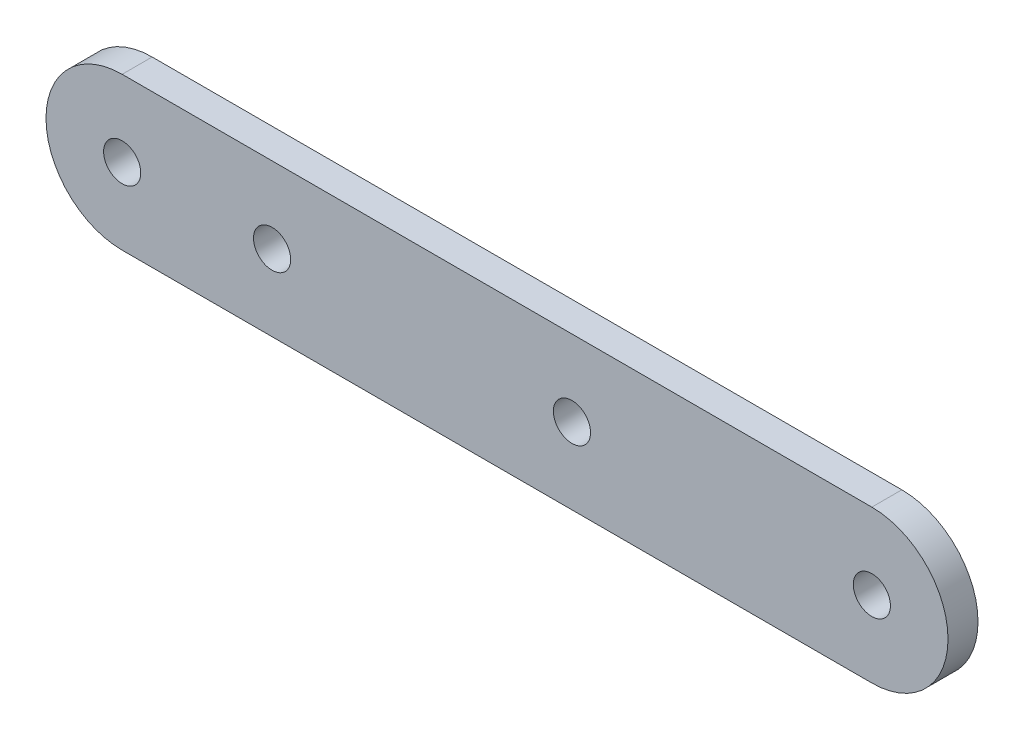
ISO-10303-21;
HEADER;
FILE_DESCRIPTION(('STEP AP214'),'2;1');
FILE_NAME('part.step','',(''),(''),'','','');
FILE_SCHEMA(('AUTOMOTIVE_DESIGN { 1 0 10303 214 1 1 1 1 }'));
ENDSEC;
DATA;
#1=APPLICATION_CONTEXT('core data for automotive mechanical design processes');
#2=APPLICATION_PROTOCOL_DEFINITION('international standard','automotive_design',2000,#1);
#3=PRODUCT_CONTEXT('',#1,'mechanical');
#4=PRODUCT('Part','Part','',(#3));
#5=PRODUCT_RELATED_PRODUCT_CATEGORY('part','',(#4));
#6=PRODUCT_DEFINITION_FORMATION('','',#4);
#7=PRODUCT_DEFINITION_CONTEXT('part definition',#1,'design');
#8=PRODUCT_DEFINITION('design','',#6,#7);
#9=PRODUCT_DEFINITION_SHAPE('','',#8);
#10=(LENGTH_UNIT() NAMED_UNIT(*) SI_UNIT(.MILLI.,.METRE.));
#11=(NAMED_UNIT(*) PLANE_ANGLE_UNIT() SI_UNIT($,.RADIAN.));
#12=(NAMED_UNIT(*) SI_UNIT($,.STERADIAN.) SOLID_ANGLE_UNIT());
#13=UNCERTAINTY_MEASURE_WITH_UNIT(LENGTH_MEASURE(1.E-05),#10,'distance_accuracy_value','');
#14=(GEOMETRIC_REPRESENTATION_CONTEXT(3) GLOBAL_UNCERTAINTY_ASSIGNED_CONTEXT((#13)) GLOBAL_UNIT_ASSIGNED_CONTEXT((#10,
#11,#12)) REPRESENTATION_CONTEXT('',''));
#15=CARTESIAN_POINT('',(0.,0.,0.));
#16=DIRECTION('',(0.,0.,1.));
#17=DIRECTION('',(1.,0.,0.));
#18=AXIS2_PLACEMENT_3D('',#15,#16,#17);
#19=CARTESIAN_POINT('',(0.,0.,5.));
#20=DIRECTION('',(0.,0.,1.));
#21=DIRECTION('',(1.,0.,0.));
#22=AXIS2_PLACEMENT_3D('',#19,#20,#21);
#23=PLANE('',#22);
#24=CARTESIAN_POINT('',(125.,0.,5.));
#25=DIRECTION('',(0.,0.,1.));
#26=DIRECTION('',(-1.,0.,0.));
#27=AXIS2_PLACEMENT_3D('',#24,#25,#26);
#28=CIRCLE('',#27,3.09999999999999);
#29=CARTESIAN_POINT('',(121.9,0.,5.));
#30=VERTEX_POINT('',#29);
#31=EDGE_CURVE('E142',#30,#30,#28,.T.);
#32=ORIENTED_EDGE('',*,*,#31,.F.);
#33=EDGE_LOOP('',(#32));
#34=FACE_BOUND('',#33,.T.);
#35=CARTESIAN_POINT('',(0.,0.,5.));
#36=DIRECTION('',(0.,0.,1.));
#37=DIRECTION('',(1.,0.,0.));
#38=AXIS2_PLACEMENT_3D('',#35,#36,#37);
#39=CIRCLE('',#38,3.1);
#40=CARTESIAN_POINT('',(3.1,0.,5.));
#41=VERTEX_POINT('',#40);
#42=EDGE_CURVE('E112',#41,#41,#39,.T.);
#43=ORIENTED_EDGE('',*,*,#42,.F.);
#44=EDGE_LOOP('',(#43));
#45=FACE_BOUND('',#44,.T.);
#46=CARTESIAN_POINT('',(0.,0.,5.));
#47=DIRECTION('',(0.,0.,1.));
#48=DIRECTION('',(1.,0.,0.));
#49=AXIS2_PLACEMENT_3D('',#46,#47,#48);
#50=CIRCLE('',#49,12.7);
#51=CARTESIAN_POINT('',(0.,12.7,5.));
#52=VERTEX_POINT('',#51);
#53=CARTESIAN_POINT('',(0.,-12.7,5.));
#54=VERTEX_POINT('',#53);
#55=EDGE_CURVE('E92',#52,#54,#50,.T.);
#56=ORIENTED_EDGE('',*,*,#55,.T.);
#57=DIRECTION('',(1.,0.,0.));
#58=VECTOR('',#57,1.);
#59=CARTESIAN_POINT('',(0.,-12.7,5.));
#60=LINE('',#59,#58);
#61=CARTESIAN_POINT('',(125.,-12.7,5.));
#62=VERTEX_POINT('',#61);
#63=EDGE_CURVE('E87',#54,#62,#60,.T.);
#64=ORIENTED_EDGE('',*,*,#63,.T.);
#65=CARTESIAN_POINT('',(125.,0.,5.));
#66=DIRECTION('',(0.,0.,1.));
#67=DIRECTION('',(-1.,0.,0.));
#68=AXIS2_PLACEMENT_3D('',#65,#66,#67);
#69=CIRCLE('',#68,12.7);
#70=CARTESIAN_POINT('',(125.,12.7,5.));
#71=VERTEX_POINT('',#70);
#72=EDGE_CURVE('E90',#62,#71,#69,.T.);
#73=ORIENTED_EDGE('',*,*,#72,.T.);
#74=DIRECTION('',(-1.,0.,0.));
#75=VECTOR('',#74,1.);
#76=CARTESIAN_POINT('',(0.,12.7,5.));
#77=LINE('',#76,#75);
#78=EDGE_CURVE('E57',#71,#52,#77,.T.);
#79=ORIENTED_EDGE('',*,*,#78,.T.);
#80=EDGE_LOOP('',(#56,#64,#73,#79));
#81=FACE_BOUND('',#80,.T.);
#82=CARTESIAN_POINT('',(25.,0.,5.));
#83=DIRECTION('',(0.,0.,1.));
#84=DIRECTION('',(1.,0.,0.));
#85=AXIS2_PLACEMENT_3D('',#82,#83,#84);
#86=CIRCLE('',#85,3.1);
#87=CARTESIAN_POINT('',(28.1,0.,5.));
#88=VERTEX_POINT('',#87);
#89=EDGE_CURVE('E134',#88,#88,#86,.T.);
#90=ORIENTED_EDGE('',*,*,#89,.F.);
#91=EDGE_LOOP('',(#90));
#92=FACE_BOUND('',#91,.T.);
#93=CARTESIAN_POINT('',(75.,0.,5.));
#94=DIRECTION('',(0.,0.,1.));
#95=DIRECTION('',(1.,0.,0.));
#96=AXIS2_PLACEMENT_3D('',#93,#94,#95);
#97=CIRCLE('',#96,3.09999999999999);
#98=CARTESIAN_POINT('',(78.1,0.,5.));
#99=VERTEX_POINT('',#98);
#100=EDGE_CURVE('E150',#99,#99,#97,.T.);
#101=ORIENTED_EDGE('',*,*,#100,.F.);
#102=EDGE_LOOP('',(#101));
#103=FACE_BOUND('',#102,.T.);
#104=ADVANCED_FACE('F39',(#34,#45,#81,#92,#103),#23,.T.);
#105=CARTESIAN_POINT('',(0.,0.,0.));
#106=DIRECTION('',(0.,0.,1.));
#107=DIRECTION('',(1.,0.,0.));
#108=AXIS2_PLACEMENT_3D('',#105,#106,#107);
#109=PLANE('',#108);
#110=CARTESIAN_POINT('',(0.,0.,0.));
#111=DIRECTION('',(0.,0.,1.));
#112=DIRECTION('',(1.,0.,0.));
#113=AXIS2_PLACEMENT_3D('',#110,#111,#112);
#114=CIRCLE('',#113,12.7);
#115=CARTESIAN_POINT('',(0.,12.7,0.));
#116=VERTEX_POINT('',#115);
#117=CARTESIAN_POINT('',(0.,-12.7,0.));
#118=VERTEX_POINT('',#117);
#119=EDGE_CURVE('E108',#116,#118,#114,.T.);
#120=ORIENTED_EDGE('',*,*,#119,.F.);
#121=DIRECTION('',(-1.,0.,0.));
#122=VECTOR('',#121,1.);
#123=CARTESIAN_POINT('',(0.,12.7,0.));
#124=LINE('',#123,#122);
#125=CARTESIAN_POINT('',(125.,12.7,0.));
#126=VERTEX_POINT('',#125);
#127=EDGE_CURVE('E80',#126,#116,#124,.T.);
#128=ORIENTED_EDGE('',*,*,#127,.F.);
#129=CARTESIAN_POINT('',(125.,0.,0.));
#130=DIRECTION('',(0.,0.,1.));
#131=DIRECTION('',(-1.,0.,0.));
#132=AXIS2_PLACEMENT_3D('',#129,#130,#131);
#133=CIRCLE('',#132,12.7);
#134=CARTESIAN_POINT('',(125.,-12.7,0.));
#135=VERTEX_POINT('',#134);
#136=EDGE_CURVE('E74',#135,#126,#133,.T.);
#137=ORIENTED_EDGE('',*,*,#136,.F.);
#138=DIRECTION('',(1.,0.,0.));
#139=VECTOR('',#138,1.);
#140=CARTESIAN_POINT('',(0.,-12.7,0.));
#141=LINE('',#140,#139);
#142=EDGE_CURVE('E97',#118,#135,#141,.T.);
#143=ORIENTED_EDGE('',*,*,#142,.F.);
#144=EDGE_LOOP('',(#120,#128,#137,#143));
#145=FACE_BOUND('',#144,.T.);
#146=CARTESIAN_POINT('',(0.,0.,0.));
#147=DIRECTION('',(0.,0.,1.));
#148=DIRECTION('',(1.,0.,0.));
#149=AXIS2_PLACEMENT_3D('',#146,#147,#148);
#150=CIRCLE('',#149,3.1);
#151=CARTESIAN_POINT('',(3.1,0.,0.));
#152=VERTEX_POINT('',#151);
#153=EDGE_CURVE('E130',#152,#152,#150,.T.);
#154=ORIENTED_EDGE('',*,*,#153,.T.);
#155=EDGE_LOOP('',(#154));
#156=FACE_BOUND('',#155,.T.);
#157=CARTESIAN_POINT('',(25.,0.,0.));
#158=DIRECTION('',(0.,0.,1.));
#159=DIRECTION('',(1.,0.,0.));
#160=AXIS2_PLACEMENT_3D('',#157,#158,#159);
#161=CIRCLE('',#160,3.1);
#162=CARTESIAN_POINT('',(28.1,0.,0.));
#163=VERTEX_POINT('',#162);
#164=EDGE_CURVE('E138',#163,#163,#161,.T.);
#165=ORIENTED_EDGE('',*,*,#164,.T.);
#166=EDGE_LOOP('',(#165));
#167=FACE_BOUND('',#166,.T.);
#168=CARTESIAN_POINT('',(125.,0.,0.));
#169=DIRECTION('',(0.,0.,1.));
#170=DIRECTION('',(-1.,0.,0.));
#171=AXIS2_PLACEMENT_3D('',#168,#169,#170);
#172=CIRCLE('',#171,3.09999999999999);
#173=CARTESIAN_POINT('',(121.9,0.,0.));
#174=VERTEX_POINT('',#173);
#175=EDGE_CURVE('E146',#174,#174,#172,.T.);
#176=ORIENTED_EDGE('',*,*,#175,.T.);
#177=EDGE_LOOP('',(#176));
#178=FACE_BOUND('',#177,.T.);
#179=CARTESIAN_POINT('',(75.,0.,0.));
#180=DIRECTION('',(0.,0.,1.));
#181=DIRECTION('',(1.,0.,0.));
#182=AXIS2_PLACEMENT_3D('',#179,#180,#181);
#183=CIRCLE('',#182,3.09999999999999);
#184=CARTESIAN_POINT('',(78.1,0.,0.));
#185=VERTEX_POINT('',#184);
#186=EDGE_CURVE('E154',#185,#185,#183,.T.);
#187=ORIENTED_EDGE('',*,*,#186,.T.);
#188=EDGE_LOOP('',(#187));
#189=FACE_BOUND('',#188,.T.);
#190=ADVANCED_FACE('F125',(#145,#156,#167,#178,#189),#109,.F.);
#191=CARTESIAN_POINT('',(0.,0.,5.));
#192=DIRECTION('',(0.,0.,-1.));
#193=DIRECTION('',(-1.,0.,0.));
#194=AXIS2_PLACEMENT_3D('',#191,#192,#193);
#195=CYLINDRICAL_SURFACE('',#194,12.7);
#196=ORIENTED_EDGE('',*,*,#119,.T.);
#197=DIRECTION('',(0.,0.,-1.));
#198=VECTOR('',#197,1.);
#199=CARTESIAN_POINT('',(0.,-12.7,5.));
#200=LINE('',#199,#198);
#201=EDGE_CURVE('E11',#54,#118,#200,.T.);
#202=ORIENTED_EDGE('',*,*,#201,.F.);
#203=ORIENTED_EDGE('',*,*,#55,.F.);
#204=DIRECTION('',(0.,0.,-1.));
#205=VECTOR('',#204,1.);
#206=CARTESIAN_POINT('',(0.,12.7,5.));
#207=LINE('',#206,#205);
#208=EDGE_CURVE('E104',#52,#116,#207,.T.);
#209=ORIENTED_EDGE('',*,*,#208,.T.);
#210=EDGE_LOOP('',(#196,#202,#203,#209));
#211=FACE_BOUND('',#210,.T.);
#212=ADVANCED_FACE('F41',(#211),#195,.T.);
#213=CARTESIAN_POINT('',(0.,-12.7,5.));
#214=DIRECTION('',(0.,1.,0.));
#215=DIRECTION('',(-1.,0.,0.));
#216=AXIS2_PLACEMENT_3D('',#213,#214,#215);
#217=PLANE('',#216);
#218=ORIENTED_EDGE('',*,*,#142,.T.);
#219=DIRECTION('',(0.,0.,-1.));
#220=VECTOR('',#219,1.);
#221=CARTESIAN_POINT('',(125.,-12.7,5.));
#222=LINE('',#221,#220);
#223=EDGE_CURVE('E49',#62,#135,#222,.T.);
#224=ORIENTED_EDGE('',*,*,#223,.F.);
#225=ORIENTED_EDGE('',*,*,#63,.F.);
#226=ORIENTED_EDGE('',*,*,#201,.T.);
#227=EDGE_LOOP('',(#218,#224,#225,#226));
#228=FACE_BOUND('',#227,.T.);
#229=ADVANCED_FACE('F96',(#228),#217,.F.);
#230=CARTESIAN_POINT('',(125.,0.,5.));
#231=DIRECTION('',(0.,0.,-1.));
#232=DIRECTION('',(-1.,0.,0.));
#233=AXIS2_PLACEMENT_3D('',#230,#231,#232);
#234=CYLINDRICAL_SURFACE('',#233,12.7);
#235=ORIENTED_EDGE('',*,*,#136,.T.);
#236=DIRECTION('',(0.,0.,-1.));
#237=VECTOR('',#236,1.);
#238=CARTESIAN_POINT('',(125.,12.7,5.));
#239=LINE('',#238,#237);
#240=EDGE_CURVE('E99',#71,#126,#239,.T.);
#241=ORIENTED_EDGE('',*,*,#240,.F.);
#242=ORIENTED_EDGE('',*,*,#72,.F.);
#243=ORIENTED_EDGE('',*,*,#223,.T.);
#244=EDGE_LOOP('',(#235,#241,#242,#243));
#245=FACE_BOUND('',#244,.T.);
#246=ADVANCED_FACE('F100',(#245),#234,.T.);
#247=CARTESIAN_POINT('',(0.,12.7,5.));
#248=DIRECTION('',(0.,-1.,0.));
#249=DIRECTION('',(1.,0.,0.));
#250=AXIS2_PLACEMENT_3D('',#247,#248,#249);
#251=PLANE('',#250);
#252=ORIENTED_EDGE('',*,*,#127,.T.);
#253=ORIENTED_EDGE('',*,*,#208,.F.);
#254=ORIENTED_EDGE('',*,*,#78,.F.);
#255=ORIENTED_EDGE('',*,*,#240,.T.);
#256=EDGE_LOOP('',(#252,#253,#254,#255));
#257=FACE_BOUND('',#256,.T.);
#258=ADVANCED_FACE('F122',(#257),#251,.F.);
#259=CARTESIAN_POINT('',(0.,0.,5.));
#260=DIRECTION('',(0.,0.,-1.));
#261=DIRECTION('',(-1.,0.,0.));
#262=AXIS2_PLACEMENT_3D('',#259,#260,#261);
#263=CYLINDRICAL_SURFACE('',#262,3.1);
#264=ORIENTED_EDGE('',*,*,#42,.T.);
#265=EDGE_LOOP('',(#264));
#266=FACE_BOUND('',#265,.T.);
#267=ORIENTED_EDGE('',*,*,#153,.F.);
#268=EDGE_LOOP('',(#267));
#269=FACE_BOUND('',#268,.T.);
#270=ADVANCED_FACE('F175',(#266,#269),#263,.F.);
#271=CARTESIAN_POINT('',(25.,0.,5.));
#272=DIRECTION('',(0.,0.,-1.));
#273=DIRECTION('',(-1.,0.,0.));
#274=AXIS2_PLACEMENT_3D('',#271,#272,#273);
#275=CYLINDRICAL_SURFACE('',#274,3.1);
#276=ORIENTED_EDGE('',*,*,#89,.T.);
#277=EDGE_LOOP('',(#276));
#278=FACE_BOUND('',#277,.T.);
#279=ORIENTED_EDGE('',*,*,#164,.F.);
#280=EDGE_LOOP('',(#279));
#281=FACE_BOUND('',#280,.T.);
#282=ADVANCED_FACE('F221',(#278,#281),#275,.F.);
#283=CARTESIAN_POINT('',(125.,0.,5.));
#284=DIRECTION('',(0.,0.,-1.));
#285=DIRECTION('',(-1.,0.,0.));
#286=AXIS2_PLACEMENT_3D('',#283,#284,#285);
#287=CYLINDRICAL_SURFACE('',#286,3.09999999999999);
#288=ORIENTED_EDGE('',*,*,#31,.T.);
#289=EDGE_LOOP('',(#288));
#290=FACE_BOUND('',#289,.T.);
#291=ORIENTED_EDGE('',*,*,#175,.F.);
#292=EDGE_LOOP('',(#291));
#293=FACE_BOUND('',#292,.T.);
#294=ADVANCED_FACE('F229',(#290,#293),#287,.F.);
#295=CARTESIAN_POINT('',(75.,0.,5.));
#296=DIRECTION('',(0.,0.,-1.));
#297=DIRECTION('',(-1.,0.,0.));
#298=AXIS2_PLACEMENT_3D('',#295,#296,#297);
#299=CYLINDRICAL_SURFACE('',#298,3.09999999999999);
#300=ORIENTED_EDGE('',*,*,#100,.T.);
#301=EDGE_LOOP('',(#300));
#302=FACE_BOUND('',#301,.T.);
#303=ORIENTED_EDGE('',*,*,#186,.F.);
#304=EDGE_LOOP('',(#303));
#305=FACE_BOUND('',#304,.T.);
#306=ADVANCED_FACE('F162',(#302,#305),#299,.F.);
#307=CLOSED_SHELL('',(#104,#190,#212,#229,#246,#258,#270,#282,#294,#306));
#308=MANIFOLD_SOLID_BREP('B2',#307);
#309=ADVANCED_BREP_SHAPE_REPRESENTATION('',(#18,#308),#14);
#310=SHAPE_DEFINITION_REPRESENTATION(#9,#309);
ENDSEC;
END-ISO-10303-21;
